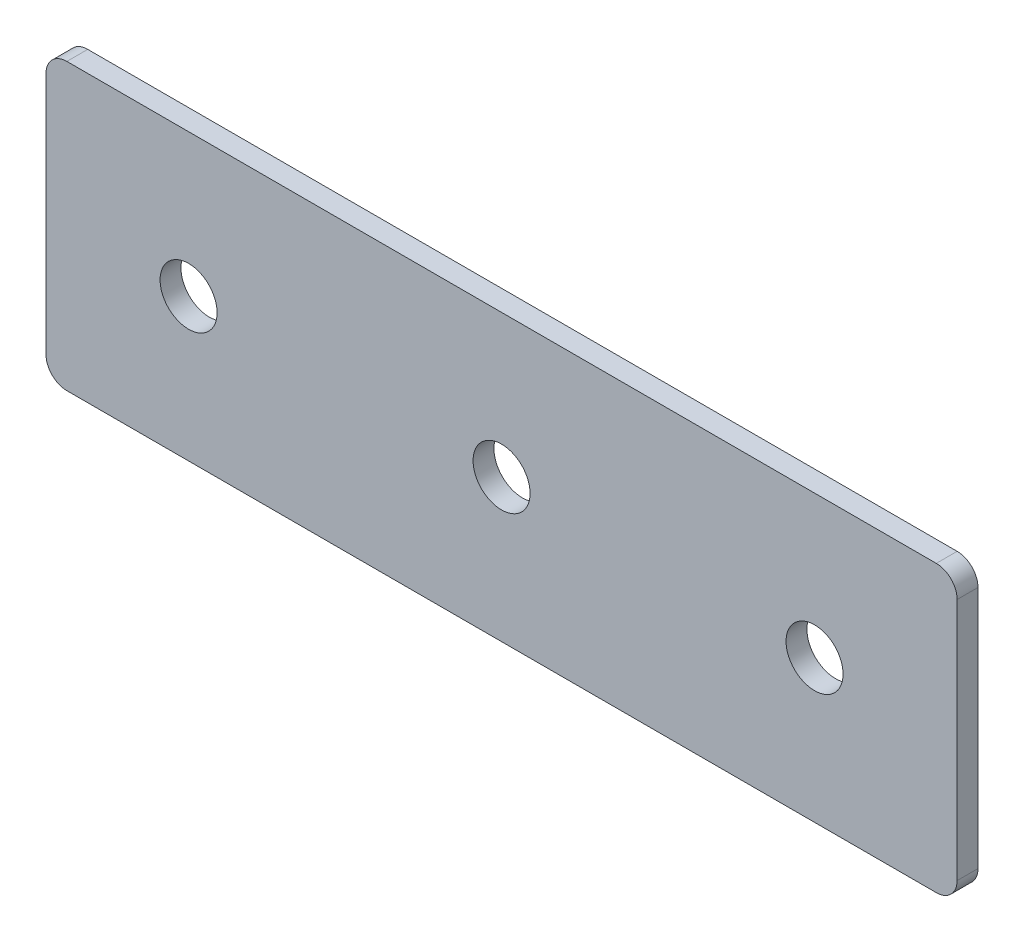
ISO-10303-21;
HEADER;
FILE_DESCRIPTION(('STEP AP214'),'2;1');
FILE_NAME('part.step','',(''),(''),'','','');
FILE_SCHEMA(('AUTOMOTIVE_DESIGN { 1 0 10303 214 1 1 1 1 }'));
ENDSEC;
DATA;
#1=APPLICATION_CONTEXT('core data for automotive mechanical design processes');
#2=APPLICATION_PROTOCOL_DEFINITION('international standard','automotive_design',2000,#1);
#3=PRODUCT_CONTEXT('',#1,'mechanical');
#4=PRODUCT('Part','Part','',(#3));
#5=PRODUCT_RELATED_PRODUCT_CATEGORY('part','',(#4));
#6=PRODUCT_DEFINITION_FORMATION('','',#4);
#7=PRODUCT_DEFINITION_CONTEXT('part definition',#1,'design');
#8=PRODUCT_DEFINITION('design','',#6,#7);
#9=PRODUCT_DEFINITION_SHAPE('','',#8);
#10=(LENGTH_UNIT() NAMED_UNIT(*) SI_UNIT(.MILLI.,.METRE.));
#11=(NAMED_UNIT(*) PLANE_ANGLE_UNIT() SI_UNIT($,.RADIAN.));
#12=(NAMED_UNIT(*) SI_UNIT($,.STERADIAN.) SOLID_ANGLE_UNIT());
#13=UNCERTAINTY_MEASURE_WITH_UNIT(LENGTH_MEASURE(1.E-05),#10,'distance_accuracy_value','');
#14=(GEOMETRIC_REPRESENTATION_CONTEXT(3) GLOBAL_UNCERTAINTY_ASSIGNED_CONTEXT((#13)) GLOBAL_UNIT_ASSIGNED_CONTEXT((#10,
#11,#12)) REPRESENTATION_CONTEXT('',''));
#15=CARTESIAN_POINT('',(0.,0.,0.));
#16=DIRECTION('',(0.,0.,1.));
#17=DIRECTION('',(1.,0.,0.));
#18=AXIS2_PLACEMENT_3D('',#15,#16,#17);
#19=CARTESIAN_POINT('',(0.,0.,3.));
#20=DIRECTION('',(0.,0.,-1.));
#21=DIRECTION('',(-1.,0.,0.));
#22=AXIS2_PLACEMENT_3D('',#19,#20,#21);
#23=PLANE('',#22);
#24=CARTESIAN_POINT('',(90.,0.,3.));
#25=DIRECTION('',(0.,0.,1.));
#26=DIRECTION('',(1.,0.,0.));
#27=AXIS2_PLACEMENT_3D('',#24,#25,#26);
#28=CIRCLE('',#27,4.1);
#29=CARTESIAN_POINT('',(94.1,0.,3.));
#30=VERTEX_POINT('',#29);
#31=EDGE_CURVE('E154',#30,#30,#28,.T.);
#32=ORIENTED_EDGE('',*,*,#31,.F.);
#33=EDGE_LOOP('',(#32));
#34=FACE_BOUND('',#33,.T.);
#35=CARTESIAN_POINT('',(45.,0.,3.));
#36=DIRECTION('',(0.,0.,1.));
#37=DIRECTION('',(1.,0.,0.));
#38=AXIS2_PLACEMENT_3D('',#35,#36,#37);
#39=CIRCLE('',#38,4.1);
#40=CARTESIAN_POINT('',(49.1,0.,3.));
#41=VERTEX_POINT('',#40);
#42=EDGE_CURVE('E160',#41,#41,#39,.T.);
#43=ORIENTED_EDGE('',*,*,#42,.F.);
#44=EDGE_LOOP('',(#43));
#45=FACE_BOUND('',#44,.T.);
#46=CARTESIAN_POINT('',(0.,0.,3.));
#47=DIRECTION('',(0.,0.,1.));
#48=DIRECTION('',(1.,0.,0.));
#49=AXIS2_PLACEMENT_3D('',#46,#47,#48);
#50=CIRCLE('',#49,4.1);
#51=CARTESIAN_POINT('',(4.1,0.,3.));
#52=VERTEX_POINT('',#51);
#53=EDGE_CURVE('E107',#52,#52,#50,.T.);
#54=ORIENTED_EDGE('',*,*,#53,.F.);
#55=EDGE_LOOP('',(#54));
#56=FACE_BOUND('',#55,.T.);
#57=DIRECTION('',(1.,0.,0.));
#58=VECTOR('',#57,1.);
#59=CARTESIAN_POINT('',(-20.5,-20.5,3.));
#60=LINE('',#59,#58);
#61=CARTESIAN_POINT('',(-17.5,-20.5,3.));
#62=VERTEX_POINT('',#61);
#63=CARTESIAN_POINT('',(107.5,-20.5,3.));
#64=VERTEX_POINT('',#63);
#65=EDGE_CURVE('E84',#62,#64,#60,.T.);
#66=ORIENTED_EDGE('',*,*,#65,.T.);
#67=CARTESIAN_POINT('',(107.5,-17.5,3.));
#68=DIRECTION('',(0.,0.,-1.));
#69=DIRECTION('',(-1.,0.,0.));
#70=AXIS2_PLACEMENT_3D('',#67,#68,#69);
#71=CIRCLE('',#70,3.);
#72=CARTESIAN_POINT('',(110.5,-17.5,3.));
#73=VERTEX_POINT('',#72);
#74=EDGE_CURVE('E91',#64,#73,#71,.F.);
#75=ORIENTED_EDGE('',*,*,#74,.T.);
#76=DIRECTION('',(0.,1.,0.));
#77=VECTOR('',#76,1.);
#78=CARTESIAN_POINT('',(110.5,-20.5,3.));
#79=LINE('',#78,#77);
#80=CARTESIAN_POINT('',(110.5,17.5,3.));
#81=VERTEX_POINT('',#80);
#82=EDGE_CURVE('E102',#73,#81,#79,.T.);
#83=ORIENTED_EDGE('',*,*,#82,.T.);
#84=CARTESIAN_POINT('',(107.5,17.5,3.));
#85=DIRECTION('',(0.,0.,-1.));
#86=DIRECTION('',(-1.,0.,0.));
#87=AXIS2_PLACEMENT_3D('',#84,#85,#86);
#88=CIRCLE('',#87,3.);
#89=CARTESIAN_POINT('',(107.5,20.5,3.));
#90=VERTEX_POINT('',#89);
#91=EDGE_CURVE('E109',#81,#90,#88,.F.);
#92=ORIENTED_EDGE('',*,*,#91,.T.);
#93=DIRECTION('',(-1.,0.,0.));
#94=VECTOR('',#93,1.);
#95=CARTESIAN_POINT('',(110.5,20.5,3.));
#96=LINE('',#95,#94);
#97=CARTESIAN_POINT('',(-17.5,20.5,3.));
#98=VERTEX_POINT('',#97);
#99=EDGE_CURVE('E139',#90,#98,#96,.T.);
#100=ORIENTED_EDGE('',*,*,#99,.T.);
#101=CARTESIAN_POINT('',(-17.5,17.5,3.));
#102=DIRECTION('',(0.,0.,-1.));
#103=DIRECTION('',(-1.,0.,0.));
#104=AXIS2_PLACEMENT_3D('',#101,#102,#103);
#105=CIRCLE('',#104,3.);
#106=CARTESIAN_POINT('',(-20.5,17.5,3.));
#107=VERTEX_POINT('',#106);
#108=EDGE_CURVE('E92',#98,#107,#105,.F.);
#109=ORIENTED_EDGE('',*,*,#108,.T.);
#110=DIRECTION('',(0.,-1.,0.));
#111=VECTOR('',#110,1.);
#112=CARTESIAN_POINT('',(-20.5,20.5,3.));
#113=LINE('',#112,#111);
#114=CARTESIAN_POINT('',(-20.5,-17.5,3.));
#115=VERTEX_POINT('',#114);
#116=EDGE_CURVE('E86',#107,#115,#113,.T.);
#117=ORIENTED_EDGE('',*,*,#116,.T.);
#118=CARTESIAN_POINT('',(-17.5,-17.5,3.));
#119=DIRECTION('',(0.,0.,-1.));
#120=DIRECTION('',(-1.,0.,0.));
#121=AXIS2_PLACEMENT_3D('',#118,#119,#120);
#122=CIRCLE('',#121,3.);
#123=EDGE_CURVE('E82',#115,#62,#122,.F.);
#124=ORIENTED_EDGE('',*,*,#123,.T.);
#125=EDGE_LOOP('',(#66,#75,#83,#92,#100,#109,#117,#124));
#126=FACE_BOUND('',#125,.T.);
#127=ADVANCED_FACE('F16',(#34,#45,#56,#126),#23,.F.);
#128=CARTESIAN_POINT('',(0.,0.,0.));
#129=DIRECTION('',(0.,0.,-1.));
#130=DIRECTION('',(-1.,0.,0.));
#131=AXIS2_PLACEMENT_3D('',#128,#129,#130);
#132=PLANE('',#131);
#133=CARTESIAN_POINT('',(90.,0.,0.));
#134=DIRECTION('',(0.,0.,1.));
#135=DIRECTION('',(1.,0.,0.));
#136=AXIS2_PLACEMENT_3D('',#133,#134,#135);
#137=CIRCLE('',#136,4.1);
#138=CARTESIAN_POINT('',(94.1,0.,0.));
#139=VERTEX_POINT('',#138);
#140=EDGE_CURVE('E150',#139,#139,#137,.T.);
#141=ORIENTED_EDGE('',*,*,#140,.T.);
#142=EDGE_LOOP('',(#141));
#143=FACE_BOUND('',#142,.T.);
#144=CARTESIAN_POINT('',(45.,0.,0.));
#145=DIRECTION('',(0.,0.,1.));
#146=DIRECTION('',(1.,0.,0.));
#147=AXIS2_PLACEMENT_3D('',#144,#145,#146);
#148=CIRCLE('',#147,4.1);
#149=CARTESIAN_POINT('',(49.1,0.,0.));
#150=VERTEX_POINT('',#149);
#151=EDGE_CURVE('E157',#150,#150,#148,.T.);
#152=ORIENTED_EDGE('',*,*,#151,.T.);
#153=EDGE_LOOP('',(#152));
#154=FACE_BOUND('',#153,.T.);
#155=CARTESIAN_POINT('',(0.,0.,0.));
#156=DIRECTION('',(0.,0.,1.));
#157=DIRECTION('',(1.,0.,0.));
#158=AXIS2_PLACEMENT_3D('',#155,#156,#157);
#159=CIRCLE('',#158,4.1);
#160=CARTESIAN_POINT('',(4.1,0.,0.));
#161=VERTEX_POINT('',#160);
#162=EDGE_CURVE('E112',#161,#161,#159,.T.);
#163=ORIENTED_EDGE('',*,*,#162,.T.);
#164=EDGE_LOOP('',(#163));
#165=FACE_BOUND('',#164,.T.);
#166=DIRECTION('',(0.,1.,0.));
#167=VECTOR('',#166,1.);
#168=CARTESIAN_POINT('',(110.5,-20.5,0.));
#169=LINE('',#168,#167);
#170=CARTESIAN_POINT('',(110.5,-17.5,0.));
#171=VERTEX_POINT('',#170);
#172=CARTESIAN_POINT('',(110.5,17.5,0.));
#173=VERTEX_POINT('',#172);
#174=EDGE_CURVE('E141',#171,#173,#169,.T.);
#175=ORIENTED_EDGE('',*,*,#174,.F.);
#176=CARTESIAN_POINT('',(107.5,-17.5,0.));
#177=DIRECTION('',(0.,0.,-1.));
#178=DIRECTION('',(-1.,0.,0.));
#179=AXIS2_PLACEMENT_3D('',#176,#177,#178);
#180=CIRCLE('',#179,3.);
#181=CARTESIAN_POINT('',(107.5,-20.5,0.));
#182=VERTEX_POINT('',#181);
#183=EDGE_CURVE('E128',#171,#182,#180,.T.);
#184=ORIENTED_EDGE('',*,*,#183,.T.);
#185=DIRECTION('',(1.,0.,0.));
#186=VECTOR('',#185,1.);
#187=CARTESIAN_POINT('',(-20.5,-20.5,0.));
#188=LINE('',#187,#186);
#189=CARTESIAN_POINT('',(-17.5,-20.5,0.));
#190=VERTEX_POINT('',#189);
#191=EDGE_CURVE('E138',#190,#182,#188,.T.);
#192=ORIENTED_EDGE('',*,*,#191,.F.);
#193=CARTESIAN_POINT('',(-17.5,-17.5,0.));
#194=DIRECTION('',(0.,0.,-1.));
#195=DIRECTION('',(-1.,0.,0.));
#196=AXIS2_PLACEMENT_3D('',#193,#194,#195);
#197=CIRCLE('',#196,3.);
#198=CARTESIAN_POINT('',(-20.5,-17.5,0.));
#199=VERTEX_POINT('',#198);
#200=EDGE_CURVE('E106',#190,#199,#197,.T.);
#201=ORIENTED_EDGE('',*,*,#200,.T.);
#202=DIRECTION('',(0.,-1.,0.));
#203=VECTOR('',#202,1.);
#204=CARTESIAN_POINT('',(-20.5,20.5,0.));
#205=LINE('',#204,#203);
#206=CARTESIAN_POINT('',(-20.5,17.5,0.));
#207=VERTEX_POINT('',#206);
#208=EDGE_CURVE('E137',#207,#199,#205,.T.);
#209=ORIENTED_EDGE('',*,*,#208,.F.);
#210=CARTESIAN_POINT('',(-17.5,17.5,0.));
#211=DIRECTION('',(0.,0.,-1.));
#212=DIRECTION('',(-1.,0.,0.));
#213=AXIS2_PLACEMENT_3D('',#210,#211,#212);
#214=CIRCLE('',#213,3.);
#215=CARTESIAN_POINT('',(-17.5,20.5,0.));
#216=VERTEX_POINT('',#215);
#217=EDGE_CURVE('E31',#207,#216,#214,.T.);
#218=ORIENTED_EDGE('',*,*,#217,.T.);
#219=DIRECTION('',(-1.,0.,0.));
#220=VECTOR('',#219,1.);
#221=CARTESIAN_POINT('',(110.5,20.5,0.));
#222=LINE('',#221,#220);
#223=CARTESIAN_POINT('',(107.5,20.5,0.));
#224=VERTEX_POINT('',#223);
#225=EDGE_CURVE('E148',#224,#216,#222,.T.);
#226=ORIENTED_EDGE('',*,*,#225,.F.);
#227=CARTESIAN_POINT('',(107.5,17.5,0.));
#228=DIRECTION('',(0.,0.,-1.));
#229=DIRECTION('',(-1.,0.,0.));
#230=AXIS2_PLACEMENT_3D('',#227,#228,#229);
#231=CIRCLE('',#230,3.);
#232=EDGE_CURVE('E124',#224,#173,#231,.T.);
#233=ORIENTED_EDGE('',*,*,#232,.T.);
#234=EDGE_LOOP('',(#175,#184,#192,#201,#209,#218,#226,#233));
#235=FACE_BOUND('',#234,.T.);
#236=ADVANCED_FACE('F166',(#143,#154,#165,#235),#132,.T.);
#237=CARTESIAN_POINT('',(0.,0.,3.));
#238=DIRECTION('',(0.,0.,-1.));
#239=DIRECTION('',(-1.,0.,0.));
#240=AXIS2_PLACEMENT_3D('',#237,#238,#239);
#241=CYLINDRICAL_SURFACE('',#240,4.1);
#242=ORIENTED_EDGE('',*,*,#53,.T.);
#243=EDGE_LOOP('',(#242));
#244=FACE_BOUND('',#243,.T.);
#245=ORIENTED_EDGE('',*,*,#162,.F.);
#246=EDGE_LOOP('',(#245));
#247=FACE_BOUND('',#246,.T.);
#248=ADVANCED_FACE('F172',(#244,#247),#241,.F.);
#249=CARTESIAN_POINT('',(45.,0.,3.));
#250=DIRECTION('',(0.,0.,-1.));
#251=DIRECTION('',(-1.,0.,0.));
#252=AXIS2_PLACEMENT_3D('',#249,#250,#251);
#253=CYLINDRICAL_SURFACE('',#252,4.1);
#254=ORIENTED_EDGE('',*,*,#42,.T.);
#255=EDGE_LOOP('',(#254));
#256=FACE_BOUND('',#255,.T.);
#257=ORIENTED_EDGE('',*,*,#151,.F.);
#258=EDGE_LOOP('',(#257));
#259=FACE_BOUND('',#258,.T.);
#260=ADVANCED_FACE('F169',(#256,#259),#253,.F.);
#261=CARTESIAN_POINT('',(90.,0.,3.));
#262=DIRECTION('',(0.,0.,-1.));
#263=DIRECTION('',(-1.,0.,0.));
#264=AXIS2_PLACEMENT_3D('',#261,#262,#263);
#265=CYLINDRICAL_SURFACE('',#264,4.1);
#266=ORIENTED_EDGE('',*,*,#31,.T.);
#267=EDGE_LOOP('',(#266));
#268=FACE_BOUND('',#267,.T.);
#269=ORIENTED_EDGE('',*,*,#140,.F.);
#270=EDGE_LOOP('',(#269));
#271=FACE_BOUND('',#270,.T.);
#272=ADVANCED_FACE('F171',(#268,#271),#265,.F.);
#273=CARTESIAN_POINT('',(-20.5,20.5,0.));
#274=DIRECTION('',(-1.,0.,0.));
#275=DIRECTION('',(0.,0.,1.));
#276=AXIS2_PLACEMENT_3D('',#273,#274,#275);
#277=PLANE('',#276);
#278=ORIENTED_EDGE('',*,*,#208,.T.);
#279=DIRECTION('',(0.,0.,1.));
#280=VECTOR('',#279,1.);
#281=CARTESIAN_POINT('',(-20.5,-17.5,0.));
#282=LINE('',#281,#280);
#283=EDGE_CURVE('E132',#199,#115,#282,.T.);
#284=ORIENTED_EDGE('',*,*,#283,.T.);
#285=ORIENTED_EDGE('',*,*,#116,.F.);
#286=DIRECTION('',(0.,0.,1.));
#287=VECTOR('',#286,1.);
#288=CARTESIAN_POINT('',(-20.5,17.5,0.));
#289=LINE('',#288,#287);
#290=EDGE_CURVE('E130',#107,#207,#289,.F.);
#291=ORIENTED_EDGE('',*,*,#290,.T.);
#292=EDGE_LOOP('',(#278,#284,#285,#291));
#293=FACE_BOUND('',#292,.T.);
#294=ADVANCED_FACE('F135',(#293),#277,.T.);
#295=CARTESIAN_POINT('',(110.5,20.5,0.));
#296=DIRECTION('',(0.,1.,0.));
#297=DIRECTION('',(0.,0.,1.));
#298=AXIS2_PLACEMENT_3D('',#295,#296,#297);
#299=PLANE('',#298);
#300=ORIENTED_EDGE('',*,*,#225,.T.);
#301=DIRECTION('',(0.,0.,1.));
#302=VECTOR('',#301,1.);
#303=CARTESIAN_POINT('',(-17.5,20.5,0.));
#304=LINE('',#303,#302);
#305=EDGE_CURVE('E10',#216,#98,#304,.T.);
#306=ORIENTED_EDGE('',*,*,#305,.T.);
#307=ORIENTED_EDGE('',*,*,#99,.F.);
#308=DIRECTION('',(0.,0.,1.));
#309=VECTOR('',#308,1.);
#310=CARTESIAN_POINT('',(107.5,20.5,0.));
#311=LINE('',#310,#309);
#312=EDGE_CURVE('E24',#90,#224,#311,.F.);
#313=ORIENTED_EDGE('',*,*,#312,.T.);
#314=EDGE_LOOP('',(#300,#306,#307,#313));
#315=FACE_BOUND('',#314,.T.);
#316=ADVANCED_FACE('F208',(#315),#299,.T.);
#317=CARTESIAN_POINT('',(110.5,-20.5,0.));
#318=DIRECTION('',(1.,0.,0.));
#319=DIRECTION('',(0.,0.,-1.));
#320=AXIS2_PLACEMENT_3D('',#317,#318,#319);
#321=PLANE('',#320);
#322=ORIENTED_EDGE('',*,*,#82,.F.);
#323=DIRECTION('',(0.,0.,1.));
#324=VECTOR('',#323,1.);
#325=CARTESIAN_POINT('',(110.5,-17.5,0.));
#326=LINE('',#325,#324);
#327=EDGE_CURVE('E122',#73,#171,#326,.F.);
#328=ORIENTED_EDGE('',*,*,#327,.T.);
#329=ORIENTED_EDGE('',*,*,#174,.T.);
#330=DIRECTION('',(0.,0.,1.));
#331=VECTOR('',#330,1.);
#332=CARTESIAN_POINT('',(110.5,17.5,0.));
#333=LINE('',#332,#331);
#334=EDGE_CURVE('E119',#173,#81,#333,.T.);
#335=ORIENTED_EDGE('',*,*,#334,.T.);
#336=EDGE_LOOP('',(#322,#328,#329,#335));
#337=FACE_BOUND('',#336,.T.);
#338=ADVANCED_FACE('F213',(#337),#321,.T.);
#339=CARTESIAN_POINT('',(-20.5,-20.5,0.));
#340=DIRECTION('',(0.,-1.,0.));
#341=DIRECTION('',(0.,0.,-1.));
#342=AXIS2_PLACEMENT_3D('',#339,#340,#341);
#343=PLANE('',#342);
#344=ORIENTED_EDGE('',*,*,#191,.T.);
#345=DIRECTION('',(0.,0.,1.));
#346=VECTOR('',#345,1.);
#347=CARTESIAN_POINT('',(107.5,-20.5,0.));
#348=LINE('',#347,#346);
#349=EDGE_CURVE('E101',#182,#64,#348,.T.);
#350=ORIENTED_EDGE('',*,*,#349,.T.);
#351=ORIENTED_EDGE('',*,*,#65,.F.);
#352=DIRECTION('',(0.,0.,1.));
#353=VECTOR('',#352,1.);
#354=CARTESIAN_POINT('',(-17.5,-20.5,0.));
#355=LINE('',#354,#353);
#356=EDGE_CURVE('E98',#62,#190,#355,.F.);
#357=ORIENTED_EDGE('',*,*,#356,.T.);
#358=EDGE_LOOP('',(#344,#350,#351,#357));
#359=FACE_BOUND('',#358,.T.);
#360=ADVANCED_FACE('F97',(#359),#343,.T.);
#361=CARTESIAN_POINT('',(107.5,-17.5,0.));
#362=DIRECTION('',(0.,0.,1.));
#363=DIRECTION('',(1.,0.,0.));
#364=AXIS2_PLACEMENT_3D('',#361,#362,#363);
#365=CYLINDRICAL_SURFACE('',#364,3.);
#366=ORIENTED_EDGE('',*,*,#183,.F.);
#367=ORIENTED_EDGE('',*,*,#327,.F.);
#368=ORIENTED_EDGE('',*,*,#74,.F.);
#369=ORIENTED_EDGE('',*,*,#349,.F.);
#370=EDGE_LOOP('',(#366,#367,#368,#369));
#371=FACE_BOUND('',#370,.T.);
#372=ADVANCED_FACE('F195',(#371),#365,.T.);
#373=CARTESIAN_POINT('',(-17.5,-17.5,0.));
#374=DIRECTION('',(0.,0.,1.));
#375=DIRECTION('',(1.,0.,0.));
#376=AXIS2_PLACEMENT_3D('',#373,#374,#375);
#377=CYLINDRICAL_SURFACE('',#376,3.);
#378=ORIENTED_EDGE('',*,*,#200,.F.);
#379=ORIENTED_EDGE('',*,*,#356,.F.);
#380=ORIENTED_EDGE('',*,*,#123,.F.);
#381=ORIENTED_EDGE('',*,*,#283,.F.);
#382=EDGE_LOOP('',(#378,#379,#380,#381));
#383=FACE_BOUND('',#382,.T.);
#384=ADVANCED_FACE('F105',(#383),#377,.T.);
#385=CARTESIAN_POINT('',(-17.5,17.5,0.));
#386=DIRECTION('',(0.,0.,1.));
#387=DIRECTION('',(1.,0.,0.));
#388=AXIS2_PLACEMENT_3D('',#385,#386,#387);
#389=CYLINDRICAL_SURFACE('',#388,3.);
#390=ORIENTED_EDGE('',*,*,#217,.F.);
#391=ORIENTED_EDGE('',*,*,#290,.F.);
#392=ORIENTED_EDGE('',*,*,#108,.F.);
#393=ORIENTED_EDGE('',*,*,#305,.F.);
#394=EDGE_LOOP('',(#390,#391,#392,#393));
#395=FACE_BOUND('',#394,.T.);
#396=ADVANCED_FACE('F200',(#395),#389,.T.);
#397=CARTESIAN_POINT('',(107.5,17.5,0.));
#398=DIRECTION('',(0.,0.,1.));
#399=DIRECTION('',(1.,0.,0.));
#400=AXIS2_PLACEMENT_3D('',#397,#398,#399);
#401=CYLINDRICAL_SURFACE('',#400,3.);
#402=ORIENTED_EDGE('',*,*,#232,.F.);
#403=ORIENTED_EDGE('',*,*,#312,.F.);
#404=ORIENTED_EDGE('',*,*,#91,.F.);
#405=ORIENTED_EDGE('',*,*,#334,.F.);
#406=EDGE_LOOP('',(#402,#403,#404,#405));
#407=FACE_BOUND('',#406,.T.);
#408=ADVANCED_FACE('F18',(#407),#401,.T.);
#409=CLOSED_SHELL('',(#127,#236,#248,#260,#272,#294,#316,#338,#360,#372,#384,#396,#408));
#410=MANIFOLD_SOLID_BREP('B1',#409);
#411=ADVANCED_BREP_SHAPE_REPRESENTATION('',(#18,#410),#14);
#412=SHAPE_DEFINITION_REPRESENTATION(#9,#411);
ENDSEC;
END-ISO-10303-21;
